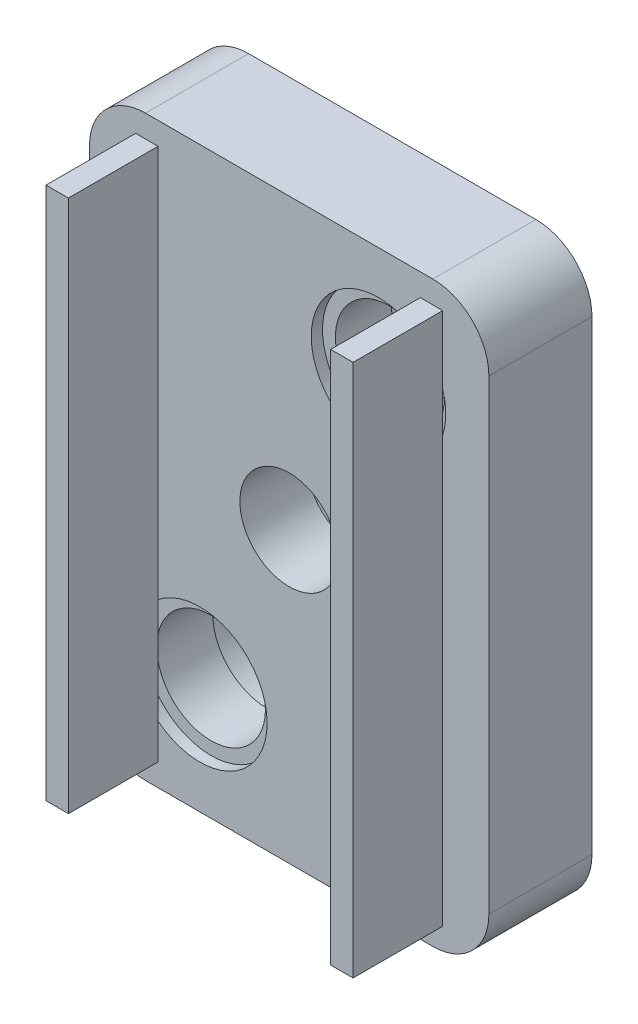
ISO-10303-21;
HEADER;
FILE_DESCRIPTION(('STEP AP214'),'2;1');
FILE_NAME('part.step','',(''),(''),'','','');
FILE_SCHEMA(('AUTOMOTIVE_DESIGN { 1 0 10303 214 1 1 1 1 }'));
ENDSEC;
DATA;
#1=APPLICATION_CONTEXT('core data for automotive mechanical design processes');
#2=APPLICATION_PROTOCOL_DEFINITION('international standard','automotive_design',2000,#1);
#3=PRODUCT_CONTEXT('',#1,'mechanical');
#4=PRODUCT('Part','Part','',(#3));
#5=PRODUCT_RELATED_PRODUCT_CATEGORY('part','',(#4));
#6=PRODUCT_DEFINITION_FORMATION('','',#4);
#7=PRODUCT_DEFINITION_CONTEXT('part definition',#1,'design');
#8=PRODUCT_DEFINITION('design','',#6,#7);
#9=PRODUCT_DEFINITION_SHAPE('','',#8);
#10=(LENGTH_UNIT() NAMED_UNIT(*) SI_UNIT(.MILLI.,.METRE.));
#11=(NAMED_UNIT(*) PLANE_ANGLE_UNIT() SI_UNIT($,.RADIAN.));
#12=(NAMED_UNIT(*) SI_UNIT($,.STERADIAN.) SOLID_ANGLE_UNIT());
#13=UNCERTAINTY_MEASURE_WITH_UNIT(LENGTH_MEASURE(1.E-05),#10,'distance_accuracy_value','');
#14=(GEOMETRIC_REPRESENTATION_CONTEXT(3) GLOBAL_UNCERTAINTY_ASSIGNED_CONTEXT((#13)) GLOBAL_UNIT_ASSIGNED_CONTEXT((#10,
#11,#12)) REPRESENTATION_CONTEXT('',''));
#15=CARTESIAN_POINT('',(0.,0.,0.));
#16=DIRECTION('',(0.,0.,1.));
#17=DIRECTION('',(1.,0.,0.));
#18=AXIS2_PLACEMENT_3D('',#15,#16,#17);
#19=CARTESIAN_POINT('',(2.5,23.29,4.6));
#20=DIRECTION('',(0.,0.,-1.));
#21=DIRECTION('',(-1.,0.,0.));
#22=AXIS2_PLACEMENT_3D('',#19,#20,#21);
#23=PLANE('',#22);
#24=CARTESIAN_POINT('',(8.91,12.895,4.6));
#25=DIRECTION('',(0.,0.,1.));
#26=DIRECTION('',(1.,0.,0.));
#27=AXIS2_PLACEMENT_3D('',#24,#25,#26);
#28=CIRCLE('',#27,2.2);
#29=CARTESIAN_POINT('',(11.11,12.895,4.6));
#30=VERTEX_POINT('',#29);
#31=EDGE_CURVE('E237',#30,#30,#28,.T.);
#32=ORIENTED_EDGE('',*,*,#31,.F.);
#33=EDGE_LOOP('',(#32));
#34=FACE_BOUND('',#33,.T.);
#35=CARTESIAN_POINT('',(2.5,23.29,4.6));
#36=DIRECTION('',(0.,0.,1.));
#37=DIRECTION('',(-1.,0.,0.));
#38=AXIS2_PLACEMENT_3D('',#35,#36,#37);
#39=CIRCLE('',#38,2.5);
#40=CARTESIAN_POINT('',(2.50000000000002,25.79,4.6));
#41=VERTEX_POINT('',#40);
#42=CARTESIAN_POINT('',(0.,23.29,4.6));
#43=VERTEX_POINT('',#42);
#44=EDGE_CURVE('E273',#41,#43,#39,.T.);
#45=ORIENTED_EDGE('',*,*,#44,.T.);
#46=DIRECTION('',(0.,-1.,0.));
#47=VECTOR('',#46,1.);
#48=CARTESIAN_POINT('',(0.,2.50000000000002,4.6));
#49=LINE('',#48,#47);
#50=CARTESIAN_POINT('',(0.,2.50000000000002,4.6));
#51=VERTEX_POINT('',#50);
#52=EDGE_CURVE('E276',#43,#51,#49,.T.);
#53=ORIENTED_EDGE('',*,*,#52,.T.);
#54=CARTESIAN_POINT('',(2.5,2.5,4.6));
#55=DIRECTION('',(0.,0.,1.));
#56=DIRECTION('',(-1.,0.,0.));
#57=AXIS2_PLACEMENT_3D('',#54,#55,#56);
#58=CIRCLE('',#57,2.5);
#59=CARTESIAN_POINT('',(2.50000000000002,0.,4.6));
#60=VERTEX_POINT('',#59);
#61=EDGE_CURVE('E279',#51,#60,#58,.T.);
#62=ORIENTED_EDGE('',*,*,#61,.T.);
#63=DIRECTION('',(1.,0.,0.));
#64=VECTOR('',#63,1.);
#65=CARTESIAN_POINT('',(2.50000000000002,0.,4.6));
#66=LINE('',#65,#64);
#67=CARTESIAN_POINT('',(15.32,0.,4.6));
#68=VERTEX_POINT('',#67);
#69=EDGE_CURVE('E281',#60,#68,#66,.T.);
#70=ORIENTED_EDGE('',*,*,#69,.T.);
#71=CARTESIAN_POINT('',(15.32,2.5,4.6));
#72=DIRECTION('',(0.,0.,1.));
#73=DIRECTION('',(1.,0.,0.));
#74=AXIS2_PLACEMENT_3D('',#71,#72,#73);
#75=CIRCLE('',#74,2.5);
#76=CARTESIAN_POINT('',(17.82,2.5,4.6));
#77=VERTEX_POINT('',#76);
#78=EDGE_CURVE('E283',#68,#77,#75,.T.);
#79=ORIENTED_EDGE('',*,*,#78,.T.);
#80=DIRECTION('',(0.,1.,0.));
#81=VECTOR('',#80,1.);
#82=CARTESIAN_POINT('',(17.82,2.50000000000002,4.6));
#83=LINE('',#82,#81);
#84=CARTESIAN_POINT('',(17.82,23.29,4.6));
#85=VERTEX_POINT('',#84);
#86=EDGE_CURVE('E285',#77,#85,#83,.T.);
#87=ORIENTED_EDGE('',*,*,#86,.T.);
#88=CARTESIAN_POINT('',(15.32,23.29,4.6));
#89=DIRECTION('',(0.,0.,1.));
#90=DIRECTION('',(-1.,0.,0.));
#91=AXIS2_PLACEMENT_3D('',#88,#89,#90);
#92=CIRCLE('',#91,2.5);
#93=CARTESIAN_POINT('',(15.32,25.79,4.6));
#94=VERTEX_POINT('',#93);
#95=EDGE_CURVE('E287',#85,#94,#92,.T.);
#96=ORIENTED_EDGE('',*,*,#95,.T.);
#97=DIRECTION('',(-1.,0.,0.));
#98=VECTOR('',#97,1.);
#99=CARTESIAN_POINT('',(2.50000000000002,25.79,4.6));
#100=LINE('',#99,#98);
#101=EDGE_CURVE('E289',#94,#41,#100,.T.);
#102=ORIENTED_EDGE('',*,*,#101,.T.);
#103=EDGE_LOOP('',(#45,#53,#62,#70,#79,#87,#96,#102));
#104=FACE_BOUND('',#103,.T.);
#105=DIRECTION('',(0.,-1.,0.));
#106=VECTOR('',#105,1.);
#107=CARTESIAN_POINT('',(2.06,24.79,4.6));
#108=LINE('',#107,#106);
#109=CARTESIAN_POINT('',(2.06,24.79,4.6));
#110=VERTEX_POINT('',#109);
#111=CARTESIAN_POINT('',(2.06,5.81481739699784,4.6));
#112=VERTEX_POINT('',#111);
#113=EDGE_CURVE('E202',#110,#112,#108,.T.);
#114=ORIENTED_EDGE('',*,*,#113,.F.);
#115=DIRECTION('',(-1.,0.,0.));
#116=VECTOR('',#115,1.);
#117=CARTESIAN_POINT('',(2.06,24.79,4.6));
#118=LINE('',#117,#116);
#119=CARTESIAN_POINT('',(3.06,24.79,4.6));
#120=VERTEX_POINT('',#119);
#121=EDGE_CURVE('E212',#120,#110,#118,.T.);
#122=ORIENTED_EDGE('',*,*,#121,.F.);
#123=DIRECTION('',(0.,1.,0.));
#124=VECTOR('',#123,1.);
#125=CARTESIAN_POINT('',(3.06,24.79,4.6));
#126=LINE('',#125,#124);
#127=CARTESIAN_POINT('',(3.06,7.27484573961782,4.6));
#128=VERTEX_POINT('',#127);
#129=EDGE_CURVE('E11',#128,#120,#126,.T.);
#130=ORIENTED_EDGE('',*,*,#129,.F.);
#131=CARTESIAN_POINT('',(4.925,4.925,4.6));
#132=DIRECTION('',(0.,0.,1.));
#133=DIRECTION('',(1.,0.,0.));
#134=AXIS2_PLACEMENT_3D('',#131,#132,#133);
#135=CIRCLE('',#134,3.);
#136=CARTESIAN_POINT('',(3.06,2.57515426038218,4.6));
#137=VERTEX_POINT('',#136);
#138=EDGE_CURVE('E252',#137,#128,#135,.T.);
#139=ORIENTED_EDGE('',*,*,#138,.F.);
#140=CARTESIAN_POINT('',(3.06,1.,4.6));
#141=VERTEX_POINT('',#140);
#142=EDGE_CURVE('E43',#141,#137,#126,.T.);
#143=ORIENTED_EDGE('',*,*,#142,.F.);
#144=DIRECTION('',(1.,0.,0.));
#145=VECTOR('',#144,1.);
#146=CARTESIAN_POINT('',(2.06,1.,4.6));
#147=LINE('',#146,#145);
#148=CARTESIAN_POINT('',(2.06,1.,4.6));
#149=VERTEX_POINT('',#148);
#150=EDGE_CURVE('E220',#149,#141,#147,.T.);
#151=ORIENTED_EDGE('',*,*,#150,.F.);
#152=CARTESIAN_POINT('',(2.06,4.03518260300216,4.6));
#153=VERTEX_POINT('',#152);
#154=EDGE_CURVE('E41',#153,#149,#108,.T.);
#155=ORIENTED_EDGE('',*,*,#154,.F.);
#156=EDGE_CURVE('E251',#112,#153,#135,.T.);
#157=ORIENTED_EDGE('',*,*,#156,.F.);
#158=EDGE_LOOP('',(#114,#122,#130,#139,#143,#151,#155,#157));
#159=FACE_BOUND('',#158,.T.);
#160=DIRECTION('',(0.,1.,0.));
#161=VECTOR('',#160,1.);
#162=CARTESIAN_POINT('',(15.76,1.00000000000001,4.6));
#163=LINE('',#162,#161);
#164=CARTESIAN_POINT('',(15.76,21.7548173969978,4.6));
#165=VERTEX_POINT('',#164);
#166=CARTESIAN_POINT('',(15.76,24.79,4.6));
#167=VERTEX_POINT('',#166);
#168=EDGE_CURVE('E198',#165,#167,#163,.T.);
#169=ORIENTED_EDGE('',*,*,#168,.F.);
#170=CARTESIAN_POINT('',(12.895,20.865,4.6));
#171=DIRECTION('',(0.,0.,1.));
#172=DIRECTION('',(1.,0.,0.));
#173=AXIS2_PLACEMENT_3D('',#170,#171,#172);
#174=CIRCLE('',#173,3.);
#175=CARTESIAN_POINT('',(15.76,19.9751826030022,4.6));
#176=VERTEX_POINT('',#175);
#177=EDGE_CURVE('E241',#176,#165,#174,.T.);
#178=ORIENTED_EDGE('',*,*,#177,.F.);
#179=CARTESIAN_POINT('',(15.76,1.00000000000001,4.6));
#180=VERTEX_POINT('',#179);
#181=EDGE_CURVE('E51',#180,#176,#163,.T.);
#182=ORIENTED_EDGE('',*,*,#181,.F.);
#183=DIRECTION('',(1.,0.,0.));
#184=VECTOR('',#183,1.);
#185=CARTESIAN_POINT('',(15.76,1.00000000000001,4.6));
#186=LINE('',#185,#184);
#187=CARTESIAN_POINT('',(14.76,1.00000000000001,4.6));
#188=VERTEX_POINT('',#187);
#189=EDGE_CURVE('E194',#188,#180,#186,.T.);
#190=ORIENTED_EDGE('',*,*,#189,.F.);
#191=DIRECTION('',(0.,-1.,0.));
#192=VECTOR('',#191,1.);
#193=CARTESIAN_POINT('',(14.76,1.00000000000001,4.6));
#194=LINE('',#193,#192);
#195=CARTESIAN_POINT('',(14.76,18.5151542603822,4.6));
#196=VERTEX_POINT('',#195);
#197=EDGE_CURVE('E433',#196,#188,#194,.T.);
#198=ORIENTED_EDGE('',*,*,#197,.F.);
#199=CARTESIAN_POINT('',(14.76,23.2148457396178,4.6));
#200=VERTEX_POINT('',#199);
#201=EDGE_CURVE('E259',#200,#196,#174,.T.);
#202=ORIENTED_EDGE('',*,*,#201,.F.);
#203=CARTESIAN_POINT('',(14.76,24.79,4.6));
#204=VERTEX_POINT('',#203);
#205=EDGE_CURVE('E59',#204,#200,#194,.T.);
#206=ORIENTED_EDGE('',*,*,#205,.F.);
#207=DIRECTION('',(-1.,0.,0.));
#208=VECTOR('',#207,1.);
#209=CARTESIAN_POINT('',(15.76,24.79,4.6));
#210=LINE('',#209,#208);
#211=EDGE_CURVE('E423',#167,#204,#210,.T.);
#212=ORIENTED_EDGE('',*,*,#211,.F.);
#213=EDGE_LOOP('',(#169,#178,#182,#190,#198,#202,#206,#212));
#214=FACE_BOUND('',#213,.T.);
#215=ADVANCED_FACE('F32',(#34,#104,#159,#214),#23,.F.);
#216=CARTESIAN_POINT('',(12.895,20.865,-10.));
#217=DIRECTION('',(0.,0.,1.));
#218=DIRECTION('',(1.,0.,0.));
#219=AXIS2_PLACEMENT_3D('',#216,#217,#218);
#220=CYLINDRICAL_SURFACE('',#219,2.425);
#221=CARTESIAN_POINT('',(12.895,20.865,1.6));
#222=DIRECTION('',(0.,0.,-1.));
#223=DIRECTION('',(-1.,0.,0.));
#224=AXIS2_PLACEMENT_3D('',#221,#222,#223);
#225=CIRCLE('',#224,2.425);
#226=CARTESIAN_POINT('',(10.47,20.865,1.6));
#227=VERTEX_POINT('',#226);
#228=EDGE_CURVE('E296',#227,#227,#225,.F.);
#229=ORIENTED_EDGE('',*,*,#228,.F.);
#230=EDGE_LOOP('',(#229));
#231=FACE_BOUND('',#230,.T.);
#232=CARTESIAN_POINT('',(12.895,20.865,4.1));
#233=DIRECTION('',(0.,0.,1.));
#234=DIRECTION('',(1.,0.,0.));
#235=AXIS2_PLACEMENT_3D('',#232,#233,#234);
#236=CIRCLE('',#235,2.425);
#237=CARTESIAN_POINT('',(15.32,20.865,4.1));
#238=VERTEX_POINT('',#237);
#239=EDGE_CURVE('E36',#238,#238,#236,.F.);
#240=ORIENTED_EDGE('',*,*,#239,.F.);
#241=EDGE_LOOP('',(#240));
#242=FACE_BOUND('',#241,.T.);
#243=ADVANCED_FACE('F343',(#231,#242),#220,.F.);
#244=CARTESIAN_POINT('',(4.925,4.925,-10.));
#245=DIRECTION('',(0.,0.,1.));
#246=DIRECTION('',(1.,0.,0.));
#247=AXIS2_PLACEMENT_3D('',#244,#245,#246);
#248=CYLINDRICAL_SURFACE('',#247,2.425);
#249=CARTESIAN_POINT('',(4.925,4.925,1.6));
#250=DIRECTION('',(0.,0.,-1.));
#251=DIRECTION('',(-1.,0.,0.));
#252=AXIS2_PLACEMENT_3D('',#249,#250,#251);
#253=CIRCLE('',#252,2.425);
#254=CARTESIAN_POINT('',(2.5,4.925,1.6));
#255=VERTEX_POINT('',#254);
#256=EDGE_CURVE('E263',#255,#255,#253,.F.);
#257=ORIENTED_EDGE('',*,*,#256,.F.);
#258=EDGE_LOOP('',(#257));
#259=FACE_BOUND('',#258,.T.);
#260=CARTESIAN_POINT('',(4.925,4.925,4.1));
#261=DIRECTION('',(0.,0.,1.));
#262=DIRECTION('',(1.,0.,0.));
#263=AXIS2_PLACEMENT_3D('',#260,#261,#262);
#264=CIRCLE('',#263,2.425);
#265=CARTESIAN_POINT('',(7.35,4.925,4.1));
#266=VERTEX_POINT('',#265);
#267=EDGE_CURVE('E247',#266,#266,#264,.F.);
#268=ORIENTED_EDGE('',*,*,#267,.F.);
#269=EDGE_LOOP('',(#268));
#270=FACE_BOUND('',#269,.T.);
#271=ADVANCED_FACE('F345',(#259,#270),#248,.F.);
#272=CARTESIAN_POINT('',(2.5,23.29,4.6));
#273=DIRECTION('',(0.,0.,-1.));
#274=DIRECTION('',(-1.,0.,0.));
#275=AXIS2_PLACEMENT_3D('',#272,#273,#274);
#276=CYLINDRICAL_SURFACE('',#275,2.5);
#277=CARTESIAN_POINT('',(2.5,23.29,0.));
#278=DIRECTION('',(0.,0.,1.));
#279=DIRECTION('',(-1.,0.,0.));
#280=AXIS2_PLACEMENT_3D('',#277,#278,#279);
#281=CIRCLE('',#280,2.5);
#282=CARTESIAN_POINT('',(2.50000000000002,25.79,0.));
#283=VERTEX_POINT('',#282);
#284=CARTESIAN_POINT('',(0.,23.29,0.));
#285=VERTEX_POINT('',#284);
#286=EDGE_CURVE('E292',#283,#285,#281,.T.);
#287=ORIENTED_EDGE('',*,*,#286,.T.);
#288=DIRECTION('',(0.,0.,-1.));
#289=VECTOR('',#288,1.);
#290=CARTESIAN_POINT('',(0.,23.29,4.6));
#291=LINE('',#290,#289);
#292=EDGE_CURVE('E329',#43,#285,#291,.T.);
#293=ORIENTED_EDGE('',*,*,#292,.F.);
#294=ORIENTED_EDGE('',*,*,#44,.F.);
#295=DIRECTION('',(0.,0.,-1.));
#296=VECTOR('',#295,1.);
#297=CARTESIAN_POINT('',(2.50000000000002,25.79,4.6));
#298=LINE('',#297,#296);
#299=EDGE_CURVE('E291',#41,#283,#298,.T.);
#300=ORIENTED_EDGE('',*,*,#299,.T.);
#301=EDGE_LOOP('',(#287,#293,#294,#300));
#302=FACE_BOUND('',#301,.T.);
#303=ADVANCED_FACE('F34',(#302),#276,.T.);
#304=CARTESIAN_POINT('',(0.,2.50000000000002,4.6));
#305=DIRECTION('',(1.,0.,0.));
#306=DIRECTION('',(0.,0.,-1.));
#307=AXIS2_PLACEMENT_3D('',#304,#305,#306);
#308=PLANE('',#307);
#309=DIRECTION('',(0.,-1.,0.));
#310=VECTOR('',#309,1.);
#311=CARTESIAN_POINT('',(0.,2.50000000000002,0.));
#312=LINE('',#311,#310);
#313=CARTESIAN_POINT('',(0.,2.50000000000002,0.));
#314=VERTEX_POINT('',#313);
#315=EDGE_CURVE('E295',#285,#314,#312,.T.);
#316=ORIENTED_EDGE('',*,*,#315,.T.);
#317=DIRECTION('',(0.,0.,-1.));
#318=VECTOR('',#317,1.);
#319=CARTESIAN_POINT('',(0.,2.50000000000002,4.6));
#320=LINE('',#319,#318);
#321=EDGE_CURVE('E326',#51,#314,#320,.T.);
#322=ORIENTED_EDGE('',*,*,#321,.F.);
#323=ORIENTED_EDGE('',*,*,#52,.F.);
#324=ORIENTED_EDGE('',*,*,#292,.T.);
#325=EDGE_LOOP('',(#316,#322,#323,#324));
#326=FACE_BOUND('',#325,.T.);
#327=ADVANCED_FACE('F386',(#326),#308,.F.);
#328=CARTESIAN_POINT('',(2.5,2.5,4.6));
#329=DIRECTION('',(0.,0.,-1.));
#330=DIRECTION('',(-1.,0.,0.));
#331=AXIS2_PLACEMENT_3D('',#328,#329,#330);
#332=CYLINDRICAL_SURFACE('',#331,2.5);
#333=CARTESIAN_POINT('',(2.5,2.5,0.));
#334=DIRECTION('',(0.,0.,1.));
#335=DIRECTION('',(-1.,0.,0.));
#336=AXIS2_PLACEMENT_3D('',#333,#334,#335);
#337=CIRCLE('',#336,2.5);
#338=CARTESIAN_POINT('',(2.50000000000002,0.,0.));
#339=VERTEX_POINT('',#338);
#340=EDGE_CURVE('E298',#314,#339,#337,.T.);
#341=ORIENTED_EDGE('',*,*,#340,.T.);
#342=DIRECTION('',(0.,0.,-1.));
#343=VECTOR('',#342,1.);
#344=CARTESIAN_POINT('',(2.50000000000002,0.,4.6));
#345=LINE('',#344,#343);
#346=EDGE_CURVE('E323',#60,#339,#345,.T.);
#347=ORIENTED_EDGE('',*,*,#346,.F.);
#348=ORIENTED_EDGE('',*,*,#61,.F.);
#349=ORIENTED_EDGE('',*,*,#321,.T.);
#350=EDGE_LOOP('',(#341,#347,#348,#349));
#351=FACE_BOUND('',#350,.T.);
#352=ADVANCED_FACE('F383',(#351),#332,.T.);
#353=CARTESIAN_POINT('',(2.50000000000002,0.,4.6));
#354=DIRECTION('',(0.,1.,0.));
#355=DIRECTION('',(0.,0.,1.));
#356=AXIS2_PLACEMENT_3D('',#353,#354,#355);
#357=PLANE('',#356);
#358=DIRECTION('',(1.,0.,0.));
#359=VECTOR('',#358,1.);
#360=CARTESIAN_POINT('',(2.50000000000002,0.,0.));
#361=LINE('',#360,#359);
#362=CARTESIAN_POINT('',(15.32,0.,0.));
#363=VERTEX_POINT('',#362);
#364=EDGE_CURVE('E300',#339,#363,#361,.T.);
#365=ORIENTED_EDGE('',*,*,#364,.T.);
#366=DIRECTION('',(0.,0.,-1.));
#367=VECTOR('',#366,1.);
#368=CARTESIAN_POINT('',(15.32,0.,4.6));
#369=LINE('',#368,#367);
#370=EDGE_CURVE('E320',#68,#363,#369,.T.);
#371=ORIENTED_EDGE('',*,*,#370,.F.);
#372=ORIENTED_EDGE('',*,*,#69,.F.);
#373=ORIENTED_EDGE('',*,*,#346,.T.);
#374=EDGE_LOOP('',(#365,#371,#372,#373));
#375=FACE_BOUND('',#374,.T.);
#376=ADVANCED_FACE('F379',(#375),#357,.F.);
#377=CARTESIAN_POINT('',(15.32,2.5,4.6));
#378=DIRECTION('',(0.,0.,-1.));
#379=DIRECTION('',(-1.,0.,0.));
#380=AXIS2_PLACEMENT_3D('',#377,#378,#379);
#381=CYLINDRICAL_SURFACE('',#380,2.5);
#382=CARTESIAN_POINT('',(15.32,2.5,0.));
#383=DIRECTION('',(0.,0.,1.));
#384=DIRECTION('',(1.,0.,0.));
#385=AXIS2_PLACEMENT_3D('',#382,#383,#384);
#386=CIRCLE('',#385,2.5);
#387=CARTESIAN_POINT('',(17.82,2.5,0.));
#388=VERTEX_POINT('',#387);
#389=EDGE_CURVE('E302',#363,#388,#386,.T.);
#390=ORIENTED_EDGE('',*,*,#389,.T.);
#391=DIRECTION('',(0.,0.,-1.));
#392=VECTOR('',#391,1.);
#393=CARTESIAN_POINT('',(17.82,2.5,4.6));
#394=LINE('',#393,#392);
#395=EDGE_CURVE('E317',#77,#388,#394,.T.);
#396=ORIENTED_EDGE('',*,*,#395,.F.);
#397=ORIENTED_EDGE('',*,*,#78,.F.);
#398=ORIENTED_EDGE('',*,*,#370,.T.);
#399=EDGE_LOOP('',(#390,#396,#397,#398));
#400=FACE_BOUND('',#399,.T.);
#401=ADVANCED_FACE('F375',(#400),#381,.T.);
#402=CARTESIAN_POINT('',(17.82,2.50000000000002,4.6));
#403=DIRECTION('',(-1.,0.,0.));
#404=DIRECTION('',(0.,0.,1.));
#405=AXIS2_PLACEMENT_3D('',#402,#403,#404);
#406=PLANE('',#405);
#407=DIRECTION('',(0.,1.,0.));
#408=VECTOR('',#407,1.);
#409=CARTESIAN_POINT('',(17.82,2.50000000000002,0.));
#410=LINE('',#409,#408);
#411=CARTESIAN_POINT('',(17.82,23.29,0.));
#412=VERTEX_POINT('',#411);
#413=EDGE_CURVE('E304',#388,#412,#410,.T.);
#414=ORIENTED_EDGE('',*,*,#413,.T.);
#415=DIRECTION('',(0.,0.,-1.));
#416=VECTOR('',#415,1.);
#417=CARTESIAN_POINT('',(17.82,23.29,4.6));
#418=LINE('',#417,#416);
#419=EDGE_CURVE('E314',#85,#412,#418,.T.);
#420=ORIENTED_EDGE('',*,*,#419,.F.);
#421=ORIENTED_EDGE('',*,*,#86,.F.);
#422=ORIENTED_EDGE('',*,*,#395,.T.);
#423=EDGE_LOOP('',(#414,#420,#421,#422));
#424=FACE_BOUND('',#423,.T.);
#425=ADVANCED_FACE('F371',(#424),#406,.F.);
#426=CARTESIAN_POINT('',(15.32,23.29,4.6));
#427=DIRECTION('',(0.,0.,-1.));
#428=DIRECTION('',(-1.,0.,0.));
#429=AXIS2_PLACEMENT_3D('',#426,#427,#428);
#430=CYLINDRICAL_SURFACE('',#429,2.5);
#431=CARTESIAN_POINT('',(15.32,23.29,0.));
#432=DIRECTION('',(0.,0.,1.));
#433=DIRECTION('',(-1.,0.,0.));
#434=AXIS2_PLACEMENT_3D('',#431,#432,#433);
#435=CIRCLE('',#434,2.5);
#436=CARTESIAN_POINT('',(15.32,25.79,0.));
#437=VERTEX_POINT('',#436);
#438=EDGE_CURVE('E306',#412,#437,#435,.T.);
#439=ORIENTED_EDGE('',*,*,#438,.T.);
#440=DIRECTION('',(0.,0.,-1.));
#441=VECTOR('',#440,1.);
#442=CARTESIAN_POINT('',(15.32,25.79,4.6));
#443=LINE('',#442,#441);
#444=EDGE_CURVE('E311',#94,#437,#443,.T.);
#445=ORIENTED_EDGE('',*,*,#444,.F.);
#446=ORIENTED_EDGE('',*,*,#95,.F.);
#447=ORIENTED_EDGE('',*,*,#419,.T.);
#448=EDGE_LOOP('',(#439,#445,#446,#447));
#449=FACE_BOUND('',#448,.T.);
#450=ADVANCED_FACE('F367',(#449),#430,.T.);
#451=CARTESIAN_POINT('',(2.50000000000002,25.79,4.6));
#452=DIRECTION('',(0.,-1.,0.));
#453=DIRECTION('',(0.,0.,-1.));
#454=AXIS2_PLACEMENT_3D('',#451,#452,#453);
#455=PLANE('',#454);
#456=DIRECTION('',(-1.,0.,0.));
#457=VECTOR('',#456,1.);
#458=CARTESIAN_POINT('',(2.50000000000002,25.79,0.));
#459=LINE('',#458,#457);
#460=EDGE_CURVE('E277',#437,#283,#459,.T.);
#461=ORIENTED_EDGE('',*,*,#460,.T.);
#462=ORIENTED_EDGE('',*,*,#299,.F.);
#463=ORIENTED_EDGE('',*,*,#101,.F.);
#464=ORIENTED_EDGE('',*,*,#444,.T.);
#465=EDGE_LOOP('',(#461,#462,#463,#464));
#466=FACE_BOUND('',#465,.T.);
#467=ADVANCED_FACE('F363',(#466),#455,.F.);
#468=CARTESIAN_POINT('',(2.5,23.29,0.));
#469=DIRECTION('',(0.,0.,-1.));
#470=DIRECTION('',(-1.,0.,0.));
#471=AXIS2_PLACEMENT_3D('',#468,#469,#470);
#472=PLANE('',#471);
#473=CARTESIAN_POINT('',(12.895,20.865,0.));
#474=DIRECTION('',(0.,0.,-1.));
#475=DIRECTION('',(-1.,0.,0.));
#476=AXIS2_PLACEMENT_3D('',#473,#474,#475);
#477=CIRCLE('',#476,3.);
#478=CARTESIAN_POINT('',(9.895,20.865,0.));
#479=VERTEX_POINT('',#478);
#480=EDGE_CURVE('E264',#479,#479,#477,.T.);
#481=ORIENTED_EDGE('',*,*,#480,.F.);
#482=EDGE_LOOP('',(#481));
#483=FACE_BOUND('',#482,.T.);
#484=CARTESIAN_POINT('',(4.925,4.925,0.));
#485=DIRECTION('',(0.,0.,-1.));
#486=DIRECTION('',(-1.,0.,0.));
#487=AXIS2_PLACEMENT_3D('',#484,#485,#486);
#488=CIRCLE('',#487,3.);
#489=CARTESIAN_POINT('',(1.925,4.925,0.));
#490=VERTEX_POINT('',#489);
#491=EDGE_CURVE('E270',#490,#490,#488,.T.);
#492=ORIENTED_EDGE('',*,*,#491,.F.);
#493=EDGE_LOOP('',(#492));
#494=FACE_BOUND('',#493,.T.);
#495=ORIENTED_EDGE('',*,*,#286,.F.);
#496=ORIENTED_EDGE('',*,*,#460,.F.);
#497=ORIENTED_EDGE('',*,*,#438,.F.);
#498=ORIENTED_EDGE('',*,*,#413,.F.);
#499=ORIENTED_EDGE('',*,*,#389,.F.);
#500=ORIENTED_EDGE('',*,*,#364,.F.);
#501=ORIENTED_EDGE('',*,*,#340,.F.);
#502=ORIENTED_EDGE('',*,*,#315,.F.);
#503=EDGE_LOOP('',(#495,#496,#497,#498,#499,#500,#501,#502));
#504=FACE_BOUND('',#503,.T.);
#505=ADVANCED_FACE('F359',(#483,#494,#504),#472,.T.);
#506=CARTESIAN_POINT('',(4.925,4.925,1.6));
#507=DIRECTION('',(0.,0.,-1.));
#508=DIRECTION('',(-1.,0.,0.));
#509=AXIS2_PLACEMENT_3D('',#506,#507,#508);
#510=PLANE('',#509);
#511=CARTESIAN_POINT('',(4.925,4.925,1.6));
#512=DIRECTION('',(0.,0.,-1.));
#513=DIRECTION('',(-1.,0.,0.));
#514=AXIS2_PLACEMENT_3D('',#511,#512,#513);
#515=CIRCLE('',#514,3.);
#516=CARTESIAN_POINT('',(1.925,4.925,1.6));
#517=VERTEX_POINT('',#516);
#518=EDGE_CURVE('E267',#517,#517,#515,.T.);
#519=ORIENTED_EDGE('',*,*,#518,.T.);
#520=EDGE_LOOP('',(#519));
#521=FACE_BOUND('',#520,.T.);
#522=ORIENTED_EDGE('',*,*,#256,.T.);
#523=EDGE_LOOP('',(#522));
#524=FACE_BOUND('',#523,.T.);
#525=ADVANCED_FACE('F362',(#521,#524),#510,.T.);
#526=CARTESIAN_POINT('',(4.925,4.925,1.6));
#527=DIRECTION('',(0.,0.,-1.));
#528=DIRECTION('',(-1.,0.,0.));
#529=AXIS2_PLACEMENT_3D('',#526,#527,#528);
#530=CYLINDRICAL_SURFACE('',#529,3.);
#531=ORIENTED_EDGE('',*,*,#518,.F.);
#532=EDGE_LOOP('',(#531));
#533=FACE_BOUND('',#532,.T.);
#534=ORIENTED_EDGE('',*,*,#491,.T.);
#535=EDGE_LOOP('',(#534));
#536=FACE_BOUND('',#535,.T.);
#537=ADVANCED_FACE('F513',(#533,#536),#530,.F.);
#538=CARTESIAN_POINT('',(12.895,20.865,1.6));
#539=DIRECTION('',(0.,0.,-1.));
#540=DIRECTION('',(-1.,0.,0.));
#541=AXIS2_PLACEMENT_3D('',#538,#539,#540);
#542=PLANE('',#541);
#543=CARTESIAN_POINT('',(12.895,20.865,1.6));
#544=DIRECTION('',(0.,0.,-1.));
#545=DIRECTION('',(-1.,0.,0.));
#546=AXIS2_PLACEMENT_3D('',#543,#544,#545);
#547=CIRCLE('',#546,3.);
#548=CARTESIAN_POINT('',(9.895,20.865,1.6));
#549=VERTEX_POINT('',#548);
#550=EDGE_CURVE('E260',#549,#549,#547,.T.);
#551=ORIENTED_EDGE('',*,*,#550,.T.);
#552=EDGE_LOOP('',(#551));
#553=FACE_BOUND('',#552,.T.);
#554=ORIENTED_EDGE('',*,*,#228,.T.);
#555=EDGE_LOOP('',(#554));
#556=FACE_BOUND('',#555,.T.);
#557=ADVANCED_FACE('F510',(#553,#556),#542,.T.);
#558=CARTESIAN_POINT('',(12.895,20.865,1.6));
#559=DIRECTION('',(0.,0.,-1.));
#560=DIRECTION('',(-1.,0.,0.));
#561=AXIS2_PLACEMENT_3D('',#558,#559,#560);
#562=CYLINDRICAL_SURFACE('',#561,3.);
#563=ORIENTED_EDGE('',*,*,#550,.F.);
#564=EDGE_LOOP('',(#563));
#565=FACE_BOUND('',#564,.T.);
#566=ORIENTED_EDGE('',*,*,#480,.T.);
#567=EDGE_LOOP('',(#566));
#568=FACE_BOUND('',#567,.T.);
#569=ADVANCED_FACE('F505',(#565,#568),#562,.F.);
#570=CARTESIAN_POINT('',(12.895,20.865,4.1));
#571=DIRECTION('',(0.,0.,1.));
#572=DIRECTION('',(1.,0.,0.));
#573=AXIS2_PLACEMENT_3D('',#570,#571,#572);
#574=PLANE('',#573);
#575=CARTESIAN_POINT('',(12.895,20.865,4.1));
#576=DIRECTION('',(0.,0.,1.));
#577=DIRECTION('',(1.,0.,0.));
#578=AXIS2_PLACEMENT_3D('',#575,#576,#577);
#579=CIRCLE('',#578,3.);
#580=CARTESIAN_POINT('',(15.895,20.865,4.1));
#581=VERTEX_POINT('',#580);
#582=EDGE_CURVE('E253',#581,#581,#579,.T.);
#583=ORIENTED_EDGE('',*,*,#582,.T.);
#584=EDGE_LOOP('',(#583));
#585=FACE_BOUND('',#584,.T.);
#586=ORIENTED_EDGE('',*,*,#239,.T.);
#587=EDGE_LOOP('',(#586));
#588=FACE_BOUND('',#587,.T.);
#589=ADVANCED_FACE('F341',(#585,#588),#574,.T.);
#590=CARTESIAN_POINT('',(12.895,20.865,4.1));
#591=DIRECTION('',(0.,0.,1.));
#592=DIRECTION('',(1.,0.,0.));
#593=AXIS2_PLACEMENT_3D('',#590,#591,#592);
#594=CYLINDRICAL_SURFACE('',#593,3.);
#595=ORIENTED_EDGE('',*,*,#582,.F.);
#596=EDGE_LOOP('',(#595));
#597=FACE_BOUND('',#596,.T.);
#598=EDGE_CURVE('E256',#165,#200,#174,.T.);
#599=ORIENTED_EDGE('',*,*,#598,.T.);
#600=ORIENTED_EDGE('',*,*,#201,.T.);
#601=EDGE_CURVE('E429',#196,#176,#174,.T.);
#602=ORIENTED_EDGE('',*,*,#601,.T.);
#603=ORIENTED_EDGE('',*,*,#177,.T.);
#604=EDGE_LOOP('',(#599,#600,#602,#603));
#605=FACE_BOUND('',#604,.T.);
#606=ADVANCED_FACE('F427',(#597,#605),#594,.F.);
#607=CARTESIAN_POINT('',(4.925,4.925,4.1));
#608=DIRECTION('',(0.,0.,1.));
#609=DIRECTION('',(1.,0.,0.));
#610=AXIS2_PLACEMENT_3D('',#607,#608,#609);
#611=PLANE('',#610);
#612=CARTESIAN_POINT('',(4.925,4.925,4.1));
#613=DIRECTION('',(0.,0.,1.));
#614=DIRECTION('',(1.,0.,0.));
#615=AXIS2_PLACEMENT_3D('',#612,#613,#614);
#616=CIRCLE('',#615,3.);
#617=CARTESIAN_POINT('',(7.925,4.925,4.1));
#618=VERTEX_POINT('',#617);
#619=EDGE_CURVE('E244',#618,#618,#616,.T.);
#620=ORIENTED_EDGE('',*,*,#619,.T.);
#621=EDGE_LOOP('',(#620));
#622=FACE_BOUND('',#621,.T.);
#623=ORIENTED_EDGE('',*,*,#267,.T.);
#624=EDGE_LOOP('',(#623));
#625=FACE_BOUND('',#624,.T.);
#626=ADVANCED_FACE('F496',(#622,#625),#611,.T.);
#627=CARTESIAN_POINT('',(4.925,4.925,4.1));
#628=DIRECTION('',(0.,0.,1.));
#629=DIRECTION('',(1.,0.,0.));
#630=AXIS2_PLACEMENT_3D('',#627,#628,#629);
#631=CYLINDRICAL_SURFACE('',#630,3.);
#632=ORIENTED_EDGE('',*,*,#619,.F.);
#633=EDGE_LOOP('',(#632));
#634=FACE_BOUND('',#633,.T.);
#635=EDGE_CURVE('E248',#128,#112,#135,.T.);
#636=ORIENTED_EDGE('',*,*,#635,.T.);
#637=ORIENTED_EDGE('',*,*,#156,.T.);
#638=EDGE_CURVE('E743',#153,#137,#135,.T.);
#639=ORIENTED_EDGE('',*,*,#638,.T.);
#640=ORIENTED_EDGE('',*,*,#138,.T.);
#641=EDGE_LOOP('',(#636,#637,#639,#640));
#642=FACE_BOUND('',#641,.T.);
#643=ADVANCED_FACE('F494',(#634,#642),#631,.F.);
#644=CARTESIAN_POINT('',(8.91,12.895,1.6));
#645=DIRECTION('',(0.,0.,1.));
#646=DIRECTION('',(1.,0.,0.));
#647=AXIS2_PLACEMENT_3D('',#644,#645,#646);
#648=CYLINDRICAL_SURFACE('',#647,2.2);
#649=CARTESIAN_POINT('',(8.91,12.895,1.6));
#650=DIRECTION('',(0.,0.,1.));
#651=DIRECTION('',(1.,0.,0.));
#652=AXIS2_PLACEMENT_3D('',#649,#650,#651);
#653=CIRCLE('',#652,2.2);
#654=CARTESIAN_POINT('',(11.11,12.895,1.6));
#655=VERTEX_POINT('',#654);
#656=EDGE_CURVE('E238',#655,#655,#653,.T.);
#657=ORIENTED_EDGE('',*,*,#656,.F.);
#658=EDGE_LOOP('',(#657));
#659=FACE_BOUND('',#658,.T.);
#660=ORIENTED_EDGE('',*,*,#31,.T.);
#661=EDGE_LOOP('',(#660));
#662=FACE_BOUND('',#661,.T.);
#663=ADVANCED_FACE('F490',(#659,#662),#648,.F.);
#664=CARTESIAN_POINT('',(8.91,12.895,1.6));
#665=DIRECTION('',(0.,0.,1.));
#666=DIRECTION('',(1.,0.,0.));
#667=AXIS2_PLACEMENT_3D('',#664,#665,#666);
#668=PLANE('',#667);
#669=ORIENTED_EDGE('',*,*,#656,.T.);
#670=EDGE_LOOP('',(#669));
#671=FACE_BOUND('',#670,.T.);
#672=ADVANCED_FACE('F486',(#671),#668,.T.);
#673=CARTESIAN_POINT('',(2.06,24.79,8.6));
#674=DIRECTION('',(1.,0.,0.));
#675=DIRECTION('',(0.,1.,0.));
#676=AXIS2_PLACEMENT_3D('',#673,#674,#675);
#677=PLANE('',#676);
#678=ORIENTED_EDGE('',*,*,#113,.T.);
#679=EDGE_CURVE('E199',#112,#153,#108,.T.);
#680=ORIENTED_EDGE('',*,*,#679,.T.);
#681=ORIENTED_EDGE('',*,*,#154,.T.);
#682=DIRECTION('',(0.,0.,-1.));
#683=VECTOR('',#682,1.);
#684=CARTESIAN_POINT('',(2.06,1.,8.6));
#685=LINE('',#684,#683);
#686=CARTESIAN_POINT('',(2.06,1.,8.6));
#687=VERTEX_POINT('',#686);
#688=EDGE_CURVE('E234',#687,#149,#685,.T.);
#689=ORIENTED_EDGE('',*,*,#688,.F.);
#690=DIRECTION('',(0.,-1.,0.));
#691=VECTOR('',#690,1.);
#692=CARTESIAN_POINT('',(2.06,24.79,8.6));
#693=LINE('',#692,#691);
#694=CARTESIAN_POINT('',(2.06,24.79,8.6));
#695=VERTEX_POINT('',#694);
#696=EDGE_CURVE('E208',#695,#687,#693,.T.);
#697=ORIENTED_EDGE('',*,*,#696,.F.);
#698=DIRECTION('',(0.,0.,-1.));
#699=VECTOR('',#698,1.);
#700=CARTESIAN_POINT('',(2.06,24.79,8.6));
#701=LINE('',#700,#699);
#702=EDGE_CURVE('E217',#695,#110,#701,.T.);
#703=ORIENTED_EDGE('',*,*,#702,.T.);
#704=EDGE_LOOP('',(#678,#680,#681,#689,#697,#703));
#705=FACE_BOUND('',#704,.T.);
#706=ADVANCED_FACE('F482',(#705),#677,.F.);
#707=CARTESIAN_POINT('',(2.06,1.,8.6));
#708=DIRECTION('',(0.,1.,0.));
#709=DIRECTION('',(0.,0.,1.));
#710=AXIS2_PLACEMENT_3D('',#707,#708,#709);
#711=PLANE('',#710);
#712=ORIENTED_EDGE('',*,*,#150,.T.);
#713=DIRECTION('',(0.,0.,-1.));
#714=VECTOR('',#713,1.);
#715=CARTESIAN_POINT('',(3.06,1.,8.6));
#716=LINE('',#715,#714);
#717=CARTESIAN_POINT('',(3.06,1.,8.6));
#718=VERTEX_POINT('',#717);
#719=EDGE_CURVE('E231',#718,#141,#716,.T.);
#720=ORIENTED_EDGE('',*,*,#719,.F.);
#721=DIRECTION('',(1.,0.,0.));
#722=VECTOR('',#721,1.);
#723=CARTESIAN_POINT('',(2.06,1.,8.6));
#724=LINE('',#723,#722);
#725=EDGE_CURVE('E211',#687,#718,#724,.T.);
#726=ORIENTED_EDGE('',*,*,#725,.F.);
#727=ORIENTED_EDGE('',*,*,#688,.T.);
#728=EDGE_LOOP('',(#712,#720,#726,#727));
#729=FACE_BOUND('',#728,.T.);
#730=ADVANCED_FACE('F478',(#729),#711,.F.);
#731=CARTESIAN_POINT('',(3.06,24.79,8.6));
#732=DIRECTION('',(-1.,0.,0.));
#733=DIRECTION('',(0.,-1.,0.));
#734=AXIS2_PLACEMENT_3D('',#731,#732,#733);
#735=PLANE('',#734);
#736=ORIENTED_EDGE('',*,*,#142,.T.);
#737=EDGE_CURVE('E44',#137,#128,#126,.T.);
#738=ORIENTED_EDGE('',*,*,#737,.T.);
#739=ORIENTED_EDGE('',*,*,#129,.T.);
#740=DIRECTION('',(0.,0.,-1.));
#741=VECTOR('',#740,1.);
#742=CARTESIAN_POINT('',(3.06,24.79,8.6));
#743=LINE('',#742,#741);
#744=CARTESIAN_POINT('',(3.06,24.79,8.6));
#745=VERTEX_POINT('',#744);
#746=EDGE_CURVE('E228',#745,#120,#743,.T.);
#747=ORIENTED_EDGE('',*,*,#746,.F.);
#748=DIRECTION('',(0.,1.,0.));
#749=VECTOR('',#748,1.);
#750=CARTESIAN_POINT('',(3.06,24.79,8.6));
#751=LINE('',#750,#749);
#752=EDGE_CURVE('E214',#718,#745,#751,.T.);
#753=ORIENTED_EDGE('',*,*,#752,.F.);
#754=ORIENTED_EDGE('',*,*,#719,.T.);
#755=EDGE_LOOP('',(#736,#738,#739,#747,#753,#754));
#756=FACE_BOUND('',#755,.T.);
#757=ADVANCED_FACE('F474',(#756),#735,.F.);
#758=CARTESIAN_POINT('',(2.06,24.79,8.6));
#759=DIRECTION('',(0.,-1.,0.));
#760=DIRECTION('',(0.,0.,-1.));
#761=AXIS2_PLACEMENT_3D('',#758,#759,#760);
#762=PLANE('',#761);
#763=ORIENTED_EDGE('',*,*,#121,.T.);
#764=ORIENTED_EDGE('',*,*,#702,.F.);
#765=DIRECTION('',(-1.,0.,0.));
#766=VECTOR('',#765,1.);
#767=CARTESIAN_POINT('',(2.06,24.79,8.6));
#768=LINE('',#767,#766);
#769=EDGE_CURVE('E216',#745,#695,#768,.T.);
#770=ORIENTED_EDGE('',*,*,#769,.F.);
#771=ORIENTED_EDGE('',*,*,#746,.T.);
#772=EDGE_LOOP('',(#763,#764,#770,#771));
#773=FACE_BOUND('',#772,.T.);
#774=ADVANCED_FACE('F469',(#773),#762,.F.);
#775=CARTESIAN_POINT('',(0.,0.,8.6));
#776=DIRECTION('',(0.,0.,1.));
#777=DIRECTION('',(1.,0.,0.));
#778=AXIS2_PLACEMENT_3D('',#775,#776,#777);
#779=PLANE('',#778);
#780=ORIENTED_EDGE('',*,*,#696,.T.);
#781=ORIENTED_EDGE('',*,*,#725,.T.);
#782=ORIENTED_EDGE('',*,*,#752,.T.);
#783=ORIENTED_EDGE('',*,*,#769,.T.);
#784=EDGE_LOOP('',(#780,#781,#782,#783));
#785=FACE_BOUND('',#784,.T.);
#786=ADVANCED_FACE('F457',(#785),#779,.T.);
#787=CARTESIAN_POINT('',(0.,0.,4.6));
#788=DIRECTION('',(0.,0.,1.));
#789=DIRECTION('',(1.,0.,0.));
#790=AXIS2_PLACEMENT_3D('',#787,#788,#789);
#791=PLANE('',#790);
#792=ORIENTED_EDGE('',*,*,#635,.F.);
#793=ORIENTED_EDGE('',*,*,#737,.F.);
#794=ORIENTED_EDGE('',*,*,#638,.F.);
#795=ORIENTED_EDGE('',*,*,#679,.F.);
#796=EDGE_LOOP('',(#792,#793,#794,#795));
#797=FACE_BOUND('',#796,.T.);
#798=ADVANCED_FACE('F450',(#797),#791,.F.);
#799=CARTESIAN_POINT('',(0.,0.,4.6));
#800=DIRECTION('',(0.,0.,1.));
#801=DIRECTION('',(1.,0.,0.));
#802=AXIS2_PLACEMENT_3D('',#799,#800,#801);
#803=PLANE('',#802);
#804=EDGE_CURVE('E424',#176,#165,#163,.T.);
#805=ORIENTED_EDGE('',*,*,#804,.F.);
#806=ORIENTED_EDGE('',*,*,#601,.F.);
#807=EDGE_CURVE('E436',#200,#196,#194,.T.);
#808=ORIENTED_EDGE('',*,*,#807,.F.);
#809=ORIENTED_EDGE('',*,*,#598,.F.);
#810=EDGE_LOOP('',(#805,#806,#808,#809));
#811=FACE_BOUND('',#810,.T.);
#812=ADVANCED_FACE('F448',(#811),#803,.F.);
#813=CARTESIAN_POINT('',(15.76,1.00000000000001,8.6));
#814=DIRECTION('',(-1.,0.,0.));
#815=DIRECTION('',(0.,-1.,0.));
#816=AXIS2_PLACEMENT_3D('',#813,#814,#815);
#817=PLANE('',#816);
#818=ORIENTED_EDGE('',*,*,#181,.T.);
#819=ORIENTED_EDGE('',*,*,#804,.T.);
#820=ORIENTED_EDGE('',*,*,#168,.T.);
#821=DIRECTION('',(0.,0.,-1.));
#822=VECTOR('',#821,1.);
#823=CARTESIAN_POINT('',(15.76,24.79,8.6));
#824=LINE('',#823,#822);
#825=CARTESIAN_POINT('',(15.76,24.79,8.6));
#826=VERTEX_POINT('',#825);
#827=EDGE_CURVE('E181',#826,#167,#824,.T.);
#828=ORIENTED_EDGE('',*,*,#827,.F.);
#829=DIRECTION('',(0.,1.,0.));
#830=VECTOR('',#829,1.);
#831=CARTESIAN_POINT('',(15.76,1.00000000000001,8.6));
#832=LINE('',#831,#830);
#833=CARTESIAN_POINT('',(15.76,1.00000000000001,8.6));
#834=VERTEX_POINT('',#833);
#835=EDGE_CURVE('E187',#834,#826,#832,.T.);
#836=ORIENTED_EDGE('',*,*,#835,.F.);
#837=DIRECTION('',(0.,0.,-1.));
#838=VECTOR('',#837,1.);
#839=CARTESIAN_POINT('',(15.76,1.00000000000001,8.6));
#840=LINE('',#839,#838);
#841=EDGE_CURVE('E442',#834,#180,#840,.T.);
#842=ORIENTED_EDGE('',*,*,#841,.T.);
#843=EDGE_LOOP('',(#818,#819,#820,#828,#836,#842));
#844=FACE_BOUND('',#843,.T.);
#845=ADVANCED_FACE('F196',(#844),#817,.F.);
#846=CARTESIAN_POINT('',(15.76,24.79,8.6));
#847=DIRECTION('',(0.,-1.,0.));
#848=DIRECTION('',(0.,0.,-1.));
#849=AXIS2_PLACEMENT_3D('',#846,#847,#848);
#850=PLANE('',#849);
#851=ORIENTED_EDGE('',*,*,#211,.T.);
#852=DIRECTION('',(0.,0.,-1.));
#853=VECTOR('',#852,1.);
#854=CARTESIAN_POINT('',(14.76,24.79,8.6));
#855=LINE('',#854,#853);
#856=CARTESIAN_POINT('',(14.76,24.79,8.6));
#857=VERTEX_POINT('',#856);
#858=EDGE_CURVE('E183',#857,#204,#855,.T.);
#859=ORIENTED_EDGE('',*,*,#858,.F.);
#860=DIRECTION('',(-1.,0.,0.));
#861=VECTOR('',#860,1.);
#862=CARTESIAN_POINT('',(15.76,24.79,8.6));
#863=LINE('',#862,#861);
#864=EDGE_CURVE('E177',#826,#857,#863,.T.);
#865=ORIENTED_EDGE('',*,*,#864,.F.);
#866=ORIENTED_EDGE('',*,*,#827,.T.);
#867=EDGE_LOOP('',(#851,#859,#865,#866));
#868=FACE_BOUND('',#867,.T.);
#869=ADVANCED_FACE('F179',(#868),#850,.F.);
#870=CARTESIAN_POINT('',(14.76,1.00000000000001,8.6));
#871=DIRECTION('',(1.,0.,0.));
#872=DIRECTION('',(0.,1.,0.));
#873=AXIS2_PLACEMENT_3D('',#870,#871,#872);
#874=PLANE('',#873);
#875=ORIENTED_EDGE('',*,*,#205,.T.);
#876=ORIENTED_EDGE('',*,*,#807,.T.);
#877=ORIENTED_EDGE('',*,*,#197,.T.);
#878=DIRECTION('',(0.,0.,-1.));
#879=VECTOR('',#878,1.);
#880=CARTESIAN_POINT('',(14.76,1.00000000000001,8.6));
#881=LINE('',#880,#879);
#882=CARTESIAN_POINT('',(14.76,1.00000000000001,8.6));
#883=VERTEX_POINT('',#882);
#884=EDGE_CURVE('E204',#883,#188,#881,.T.);
#885=ORIENTED_EDGE('',*,*,#884,.F.);
#886=DIRECTION('',(0.,-1.,0.));
#887=VECTOR('',#886,1.);
#888=CARTESIAN_POINT('',(14.76,1.00000000000001,8.6));
#889=LINE('',#888,#887);
#890=EDGE_CURVE('E186',#857,#883,#889,.T.);
#891=ORIENTED_EDGE('',*,*,#890,.F.);
#892=ORIENTED_EDGE('',*,*,#858,.T.);
#893=EDGE_LOOP('',(#875,#876,#877,#885,#891,#892));
#894=FACE_BOUND('',#893,.T.);
#895=ADVANCED_FACE('F444',(#894),#874,.F.);
#896=CARTESIAN_POINT('',(15.76,1.00000000000001,8.6));
#897=DIRECTION('',(0.,1.,0.));
#898=DIRECTION('',(-1.,0.,0.));
#899=AXIS2_PLACEMENT_3D('',#896,#897,#898);
#900=PLANE('',#899);
#901=ORIENTED_EDGE('',*,*,#189,.T.);
#902=ORIENTED_EDGE('',*,*,#841,.F.);
#903=DIRECTION('',(1.,0.,0.));
#904=VECTOR('',#903,1.);
#905=CARTESIAN_POINT('',(15.76,1.00000000000001,8.6));
#906=LINE('',#905,#904);
#907=EDGE_CURVE('E192',#883,#834,#906,.T.);
#908=ORIENTED_EDGE('',*,*,#907,.F.);
#909=ORIENTED_EDGE('',*,*,#884,.T.);
#910=EDGE_LOOP('',(#901,#902,#908,#909));
#911=FACE_BOUND('',#910,.T.);
#912=ADVANCED_FACE('F443',(#911),#900,.F.);
#913=CARTESIAN_POINT('',(0.,0.,8.6));
#914=DIRECTION('',(0.,0.,1.));
#915=DIRECTION('',(1.,0.,0.));
#916=AXIS2_PLACEMENT_3D('',#913,#914,#915);
#917=PLANE('',#916);
#918=ORIENTED_EDGE('',*,*,#835,.T.);
#919=ORIENTED_EDGE('',*,*,#864,.T.);
#920=ORIENTED_EDGE('',*,*,#890,.T.);
#921=ORIENTED_EDGE('',*,*,#907,.T.);
#922=EDGE_LOOP('',(#918,#919,#920,#921));
#923=FACE_BOUND('',#922,.T.);
#924=ADVANCED_FACE('F190',(#923),#917,.T.);
#925=CLOSED_SHELL('',(#215,#243,#271,#303,#327,#352,#376,#401,#425,#450,#467,#505,#525,#537,
#557,#569,#589,#606,#626,#643,#663,#672,#706,#730,#757,#774,#786,#798,#812,#845,#869,#895,#912,#924));
#926=MANIFOLD_SOLID_BREP('B2',#925);
#927=ADVANCED_BREP_SHAPE_REPRESENTATION('',(#18,#926),#14);
#928=SHAPE_DEFINITION_REPRESENTATION(#9,#927);
ENDSEC;
END-ISO-10303-21;
